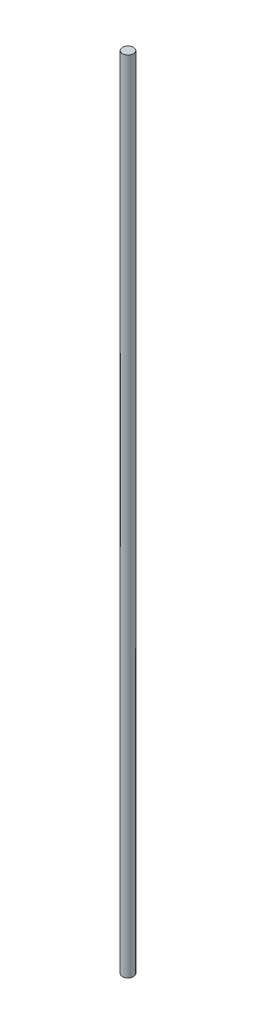
ISO-10303-21;
HEADER;
FILE_DESCRIPTION(('STEP AP214'),'2;1');
FILE_NAME('part.step','',(''),(''),'','','');
FILE_SCHEMA(('AUTOMOTIVE_DESIGN { 1 0 10303 214 1 1 1 1 }'));
ENDSEC;
DATA;
#1=APPLICATION_CONTEXT('core data for automotive mechanical design processes');
#2=APPLICATION_PROTOCOL_DEFINITION('international standard','automotive_design',2000,#1);
#3=PRODUCT_CONTEXT('',#1,'mechanical');
#4=PRODUCT('Part','Part','',(#3));
#5=PRODUCT_RELATED_PRODUCT_CATEGORY('part','',(#4));
#6=PRODUCT_DEFINITION_FORMATION('','',#4);
#7=PRODUCT_DEFINITION_CONTEXT('part definition',#1,'design');
#8=PRODUCT_DEFINITION('design','',#6,#7);
#9=PRODUCT_DEFINITION_SHAPE('','',#8);
#10=(LENGTH_UNIT() NAMED_UNIT(*) SI_UNIT(.MILLI.,.METRE.));
#11=(NAMED_UNIT(*) PLANE_ANGLE_UNIT() SI_UNIT($,.RADIAN.));
#12=(NAMED_UNIT(*) SI_UNIT($,.STERADIAN.) SOLID_ANGLE_UNIT());
#13=UNCERTAINTY_MEASURE_WITH_UNIT(LENGTH_MEASURE(1.E-05),#10,'distance_accuracy_value','');
#14=(GEOMETRIC_REPRESENTATION_CONTEXT(3) GLOBAL_UNCERTAINTY_ASSIGNED_CONTEXT((#13)) GLOBAL_UNIT_ASSIGNED_CONTEXT((#10,
#11,#12)) REPRESENTATION_CONTEXT('',''));
#15=CARTESIAN_POINT('',(0.,0.,0.));
#16=DIRECTION('',(0.,0.,1.));
#17=DIRECTION('',(1.,0.,0.));
#18=AXIS2_PLACEMENT_3D('',#15,#16,#17);
#19=CARTESIAN_POINT('',(0.,920.,0.));
#20=DIRECTION('',(0.,-1.,0.));
#21=DIRECTION('',(0.,0.,-1.));
#22=AXIS2_PLACEMENT_3D('',#19,#20,#21);
#23=CYLINDRICAL_SURFACE('',#22,6.35);
#24=CARTESIAN_POINT('',(0.,920.,0.));
#25=DIRECTION('',(0.,1.,0.));
#26=DIRECTION('',(0.,0.,1.));
#27=AXIS2_PLACEMENT_3D('',#24,#25,#26);
#28=CIRCLE('',#27,6.35);
#29=CARTESIAN_POINT('',(0.,920.,6.35));
#30=VERTEX_POINT('',#29);
#31=EDGE_CURVE('E10',#30,#30,#28,.T.);
#32=ORIENTED_EDGE('',*,*,#31,.F.);
#33=EDGE_LOOP('',(#32));
#34=FACE_BOUND('',#33,.T.);
#35=CARTESIAN_POINT('',(0.,0.,0.));
#36=DIRECTION('',(0.,1.,0.));
#37=DIRECTION('',(0.,0.,1.));
#38=AXIS2_PLACEMENT_3D('',#35,#36,#37);
#39=CIRCLE('',#38,6.35);
#40=CARTESIAN_POINT('',(0.,0.,6.35));
#41=VERTEX_POINT('',#40);
#42=EDGE_CURVE('E34',#41,#41,#39,.T.);
#43=ORIENTED_EDGE('',*,*,#42,.T.);
#44=EDGE_LOOP('',(#43));
#45=FACE_BOUND('',#44,.T.);
#46=ADVANCED_FACE('F31',(#34,#45),#23,.T.);
#47=CARTESIAN_POINT('',(0.,920.,0.));
#48=DIRECTION('',(0.,1.,0.));
#49=DIRECTION('',(0.,0.,1.));
#50=AXIS2_PLACEMENT_3D('',#47,#48,#49);
#51=PLANE('',#50);
#52=ORIENTED_EDGE('',*,*,#31,.T.);
#53=EDGE_LOOP('',(#52));
#54=FACE_BOUND('',#53,.T.);
#55=ADVANCED_FACE('F46',(#54),#51,.T.);
#56=CARTESIAN_POINT('',(0.,0.,0.));
#57=DIRECTION('',(0.,1.,0.));
#58=DIRECTION('',(0.,0.,1.));
#59=AXIS2_PLACEMENT_3D('',#56,#57,#58);
#60=PLANE('',#59);
#61=ORIENTED_EDGE('',*,*,#42,.F.);
#62=EDGE_LOOP('',(#61));
#63=FACE_BOUND('',#62,.T.);
#64=ADVANCED_FACE('F44',(#63),#60,.F.);
#65=CLOSED_SHELL('',(#46,#55,#64));
#66=MANIFOLD_SOLID_BREP('B2',#65);
#67=ADVANCED_BREP_SHAPE_REPRESENTATION('',(#18,#66),#14);
#68=SHAPE_DEFINITION_REPRESENTATION(#9,#67);
ENDSEC;
END-ISO-10303-21;
